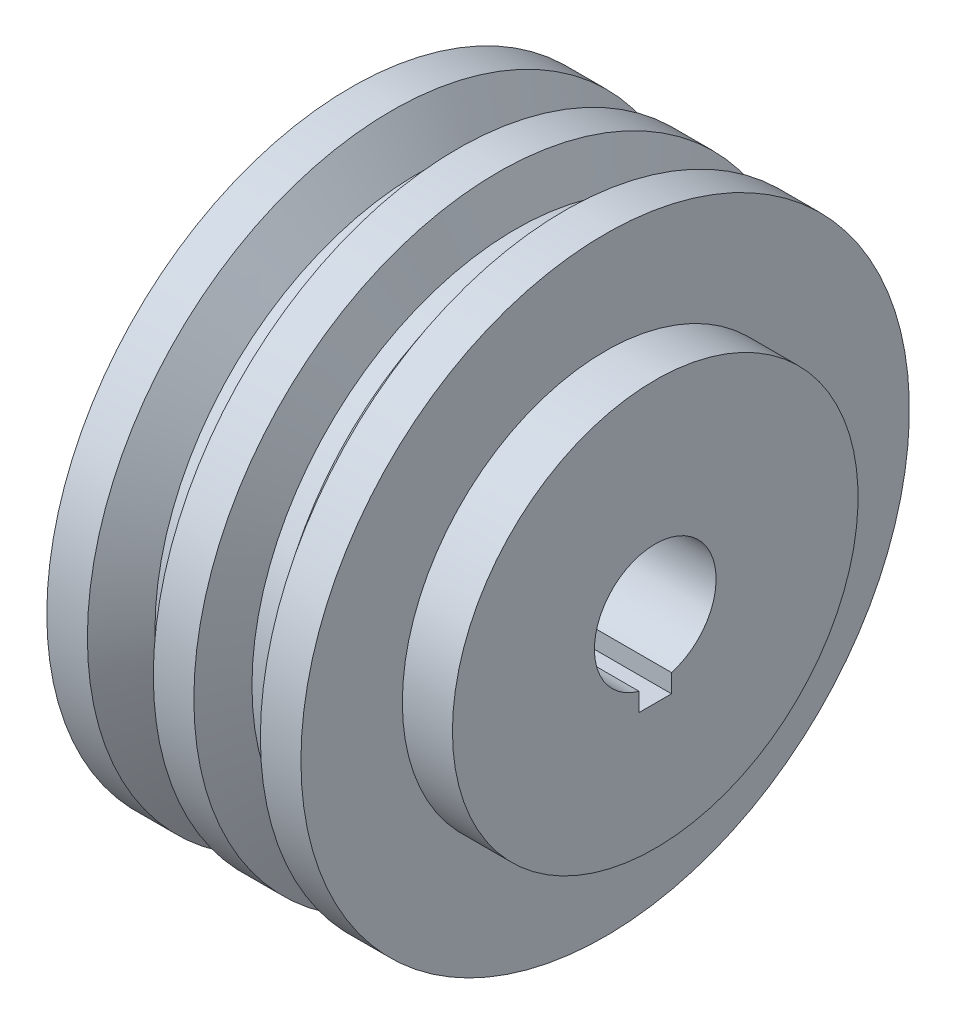
ISO-10303-21;
HEADER;
FILE_DESCRIPTION(('STEP AP214'),'2;1');
FILE_NAME('part.step','',(''),(''),'','','');
FILE_SCHEMA(('AUTOMOTIVE_DESIGN { 1 0 10303 214 1 1 1 1 }'));
ENDSEC;
DATA;
#1=APPLICATION_CONTEXT('core data for automotive mechanical design processes');
#2=APPLICATION_PROTOCOL_DEFINITION('international standard','automotive_design',2000,#1);
#3=PRODUCT_CONTEXT('',#1,'mechanical');
#4=PRODUCT('Part','Part','',(#3));
#5=PRODUCT_RELATED_PRODUCT_CATEGORY('part','',(#4));
#6=PRODUCT_DEFINITION_FORMATION('','',#4);
#7=PRODUCT_DEFINITION_CONTEXT('part definition',#1,'design');
#8=PRODUCT_DEFINITION('design','',#6,#7);
#9=PRODUCT_DEFINITION_SHAPE('','',#8);
#10=(LENGTH_UNIT() NAMED_UNIT(*) SI_UNIT(.MILLI.,.METRE.));
#11=(NAMED_UNIT(*) PLANE_ANGLE_UNIT() SI_UNIT($,.RADIAN.));
#12=(NAMED_UNIT(*) SI_UNIT($,.STERADIAN.) SOLID_ANGLE_UNIT());
#13=UNCERTAINTY_MEASURE_WITH_UNIT(LENGTH_MEASURE(1.E-05),#10,'distance_accuracy_value','');
#14=(GEOMETRIC_REPRESENTATION_CONTEXT(3) GLOBAL_UNCERTAINTY_ASSIGNED_CONTEXT((#13)) GLOBAL_UNIT_ASSIGNED_CONTEXT((#10,
#11,#12)) REPRESENTATION_CONTEXT('',''));
#15=CARTESIAN_POINT('',(0.,0.,0.));
#16=DIRECTION('',(0.,0.,1.));
#17=DIRECTION('',(1.,0.,0.));
#18=AXIS2_PLACEMENT_3D('',#15,#16,#17);
#19=CARTESIAN_POINT('',(75.,-15.,0.));
#20=DIRECTION('',(1.,0.,0.));
#21=DIRECTION('',(0.,0.,-1.));
#22=AXIS2_PLACEMENT_3D('',#19,#20,#21);
#23=PLANE('',#22);
#24=DIRECTION('',(0.,-1.,0.));
#25=VECTOR('',#24,1.);
#26=CARTESIAN_POINT('',(75.,-19.,4.));
#27=LINE('',#26,#25);
#28=CARTESIAN_POINT('',(75.,-14.456832294801,4.));
#29=VERTEX_POINT('',#28);
#30=CARTESIAN_POINT('',(75.,-19.,4.));
#31=VERTEX_POINT('',#30);
#32=EDGE_CURVE('E75',#29,#31,#27,.T.);
#33=ORIENTED_EDGE('',*,*,#32,.F.);
#34=CARTESIAN_POINT('',(75.,0.,0.));
#35=DIRECTION('',(-1.,0.,0.));
#36=DIRECTION('',(0.,0.,1.));
#37=AXIS2_PLACEMENT_3D('',#34,#35,#36);
#38=CIRCLE('',#37,15.);
#39=CARTESIAN_POINT('',(75.,-14.456832294801,-4.));
#40=VERTEX_POINT('',#39);
#41=EDGE_CURVE('E142',#29,#40,#38,.T.);
#42=ORIENTED_EDGE('',*,*,#41,.T.);
#43=DIRECTION('',(0.,1.,0.));
#44=VECTOR('',#43,1.);
#45=CARTESIAN_POINT('',(75.,-19.,-4.));
#46=LINE('',#45,#44);
#47=CARTESIAN_POINT('',(75.,-19.,-4.));
#48=VERTEX_POINT('',#47);
#49=EDGE_CURVE('E90',#48,#40,#46,.T.);
#50=ORIENTED_EDGE('',*,*,#49,.F.);
#51=DIRECTION('',(0.,0.,-1.));
#52=VECTOR('',#51,1.);
#53=CARTESIAN_POINT('',(75.,-19.,-4.));
#54=LINE('',#53,#52);
#55=EDGE_CURVE('E84',#31,#48,#54,.T.);
#56=ORIENTED_EDGE('',*,*,#55,.F.);
#57=EDGE_LOOP('',(#33,#42,#50,#56));
#58=FACE_BOUND('',#57,.T.);
#59=CARTESIAN_POINT('',(75.,0.,0.));
#60=DIRECTION('',(-1.,0.,0.));
#61=DIRECTION('',(0.,0.,1.));
#62=AXIS2_PLACEMENT_3D('',#59,#60,#61);
#63=CIRCLE('',#62,50.);
#64=CARTESIAN_POINT('',(75.,0.,50.));
#65=VERTEX_POINT('',#64);
#66=EDGE_CURVE('E100',#65,#65,#63,.T.);
#67=ORIENTED_EDGE('',*,*,#66,.F.);
#68=EDGE_LOOP('',(#67));
#69=FACE_BOUND('',#68,.T.);
#70=ADVANCED_FACE('F33',(#58,#69),#23,.T.);
#71=CARTESIAN_POINT('',(0.,0.,0.));
#72=DIRECTION('',(-1.,0.,0.));
#73=DIRECTION('',(0.,0.,1.));
#74=AXIS2_PLACEMENT_3D('',#71,#72,#73);
#75=CYLINDRICAL_SURFACE('',#74,15.);
#76=DIRECTION('',(-1.,0.,0.));
#77=VECTOR('',#76,1.);
#78=CARTESIAN_POINT('',(0.,-14.456832294801,4.));
#79=LINE('',#78,#77);
#80=CARTESIAN_POINT('',(10.,-14.456832294801,4.));
#81=VERTEX_POINT('',#80);
#82=EDGE_CURVE('E79',#81,#29,#79,.F.);
#83=ORIENTED_EDGE('',*,*,#82,.F.);
#84=CARTESIAN_POINT('',(10.,0.,0.));
#85=DIRECTION('',(-1.,0.,0.));
#86=DIRECTION('',(0.,0.,1.));
#87=AXIS2_PLACEMENT_3D('',#84,#85,#86);
#88=CIRCLE('',#87,15.);
#89=CARTESIAN_POINT('',(10.,-14.456832294801,-4.));
#90=VERTEX_POINT('',#89);
#91=EDGE_CURVE('E139',#81,#90,#88,.T.);
#92=ORIENTED_EDGE('',*,*,#91,.T.);
#93=DIRECTION('',(-1.,0.,0.));
#94=VECTOR('',#93,1.);
#95=CARTESIAN_POINT('',(0.,-14.456832294801,-4.));
#96=LINE('',#95,#94);
#97=EDGE_CURVE('E96',#40,#90,#96,.T.);
#98=ORIENTED_EDGE('',*,*,#97,.F.);
#99=ORIENTED_EDGE('',*,*,#41,.F.);
#100=EDGE_LOOP('',(#83,#92,#98,#99));
#101=FACE_BOUND('',#100,.T.);
#102=ADVANCED_FACE('F211',(#101),#75,.F.);
#103=CARTESIAN_POINT('',(10.,0.,0.));
#104=DIRECTION('',(-1.,0.,0.));
#105=DIRECTION('',(0.,0.,1.));
#106=AXIS2_PLACEMENT_3D('',#103,#104,#105);
#107=CONICAL_SURFACE('',#106,15.,1.39094282700242);
#108=CARTESIAN_POINT('',(6.39443841975416,-34.6001431873648,4.));
#109=CARTESIAN_POINT('',(6.65724573665439,-33.14490925138,4.));
#110=CARTESIAN_POINT('',(6.91989497160682,-31.689646588921,4.));
#111=CARTESIAN_POINT('',(7.44451726248369,-28.7791834678463,4.));
#112=CARTESIAN_POINT('',(7.70649039729603,-27.3239830234475,4.));
#113=CARTESIAN_POINT('',(8.09868011663034,-25.1412809404281,4.));
#114=CARTESIAN_POINT('',(8.22926114577589,-24.4138448019778,4.));
#115=CARTESIAN_POINT('',(8.49010116807986,-22.9589173210629,4.));
#116=CARTESIAN_POINT('',(8.62036016232725,-22.2314259787938,4.));
#117=CARTESIAN_POINT('',(8.88046981475311,-20.7762837310661,4.));
#118=CARTESIAN_POINT('',(9.01032042412981,-20.048632816881,4.));
#119=CARTESIAN_POINT('',(9.26944658544549,-18.5932192798698,4.));
#120=CARTESIAN_POINT('',(9.39872213025516,-17.8654566557738,4.));
#121=CARTESIAN_POINT('',(9.65430689130182,-16.4219643101513,4.));
#122=CARTESIAN_POINT('',(9.78062955118175,-15.7062369712816,4.));
#123=CARTESIAN_POINT('',(10.0321256096589,-14.2746132663618,4.));
#124=CARTESIAN_POINT('',(10.157299059378,-13.5587169092978,4.));
#125=CARTESIAN_POINT('',(10.4058634416107,-12.1268864958551,4.));
#126=CARTESIAN_POINT('',(10.5292550163011,-11.410952551358,4.));
#127=CARTESIAN_POINT('',(10.7122023396851,-10.3366264010246,4.));
#128=CARTESIAN_POINT('',(10.7728329961803,-9.97841739412837,4.));
#129=CARTESIAN_POINT('',(10.8931369443984,-9.26183881146511,4.));
#130=CARTESIAN_POINT('',(10.9528102371887,-8.90346923587753,4.));
#131=CARTESIAN_POINT('',(11.0709487652725,-8.18604346700138,4.));
#132=CARTESIAN_POINT('',(11.1294122976824,-7.82698699261588,4.));
#133=CARTESIAN_POINT('',(11.2445535787055,-7.10859497637306,4.));
#134=CARTESIAN_POINT('',(11.3012313662188,-6.74925944076965,4.));
#135=CARTESIAN_POINT('',(11.4120224327451,-6.03037545693457,4.));
#136=CARTESIAN_POINT('',(11.4661369864016,-5.6708272064922,4.));
#137=CARTESIAN_POINT('',(11.5706606837461,-4.95115502722994,4.));
#138=CARTESIAN_POINT('',(11.6210694812827,-4.59103104783378,4.));
#139=CARTESIAN_POINT('',(11.7164166351216,-3.8693881735717,4.));
#140=CARTESIAN_POINT('',(11.7613450813547,-3.50786793651586,4.));
#141=CARTESIAN_POINT('',(11.8223607490261,-2.96491409854611,4.));
#142=CARTESIAN_POINT('',(11.8416344661936,-2.78383985044046,4.));
#143=CARTESIAN_POINT('',(11.877572694754,-2.42142859084247,4.));
#144=CARTESIAN_POINT('',(11.8942371871716,-2.24009157744888,4.));
#145=CARTESIAN_POINT('',(11.9244591212835,-1.87683365944807,4.));
#146=CARTESIAN_POINT('',(11.9380110301653,-1.69491228912454,4.));
#147=CARTESIAN_POINT('',(11.9614292267963,-1.33083609914876,4.));
#148=CARTESIAN_POINT('',(11.9712956580584,-1.14868128886391,4.));
#149=CARTESIAN_POINT('',(11.9868592480669,-0.784020468197573,4.));
#150=CARTESIAN_POINT('',(11.9925525240417,-0.601514288755223,4.));
#151=CARTESIAN_POINT('',(11.9994910069143,-0.236390491266642,4.));
#152=CARTESIAN_POINT('',(12.0007355322295,-0.0537728604314214,4.));
#153=CARTESIAN_POINT('',(11.9996228476055,0.128837138415995,4.));
#154=B_SPLINE_CURVE_WITH_KNOTS('',3,(#108,#109,#110,#111,#112,#113,#114,#115,#116,#117,#118,
#119,#120,#121,#122,#123,#124,#125,#126,#127,#128,#129,#130,#131,#132,#133,#134,#135,#136,#137,
#138,#139,#140,#141,#142,#143,#144,#145,#146,#147,#148,#149,#150,#151,#152,#153),.UNSPECIFIED.,
.F.,.F.,(4,2,2,2,2,2,2,2,2,2,2,2,2,2,2,2,2,2,2,2,2,2,4),(0.,4.43632324181381,8.87210305318458,
11.0892932611385,13.3064759612918,15.5239142467702,17.7413799465459,19.9217478906655,
22.1020183677764,24.2814824264146,25.3713933816991,26.4613031218255,27.5526549526626,
28.6439829934457,29.7347625159651,30.8256437981284,31.9184693528809,32.4647459679502,
33.011026555589,33.5582708029265,34.1054937383066,34.653225174754,35.2010405242384),.UNSPECIFIED.);
#155=CARTESIAN_POINT('',(9.19700221110044,-19.,4.));
#156=VERTEX_POINT('',#155);
#157=EDGE_CURVE('E11',#156,#81,#154,.T.);
#158=ORIENTED_EDGE('',*,*,#157,.F.);
#159=CARTESIAN_POINT('',(7.54557386228406,-19.,-21.241765336351));
#160=CARTESIAN_POINT('',(7.65386469469078,-19.,-20.4423439312438));
#161=CARTESIAN_POINT('',(7.75957175496758,-19.,-19.6425633058687));
#162=CARTESIAN_POINT('',(7.96449660302058,-19.,-18.0421296385324));
#163=CARTESIAN_POINT('',(8.06371404483216,-19.,-17.2414765523694));
#164=CARTESIAN_POINT('',(8.25442855819279,-19.,-15.6383679551754));
#165=CARTESIAN_POINT('',(8.34591721602016,-19.,-14.8359114317958));
#166=CARTESIAN_POINT('',(8.51938849970379,-19.,-13.229992055274));
#167=CARTESIAN_POINT('',(8.60137124117887,-19.,-12.4265292144917));
#168=CARTESIAN_POINT('',(8.82932016987789,-19.,-10.0238824669169));
#169=CARTESIAN_POINT('',(8.95845402472932,-19.,-8.42299138295178));
#170=CARTESIAN_POINT('',(9.10610891502273,-19.,-6.01923790791078));
#171=CARTESIAN_POINT('',(9.14764857874721,-19.,-5.21777089185556));
#172=CARTESIAN_POINT('',(9.21365172001666,-19.,-3.61412227534424));
#173=CARTESIAN_POINT('',(9.23811531408736,-19.,-2.81194067980177));
#174=CARTESIAN_POINT('',(9.26882068132095,-19.,-1.2062225394813));
#175=CARTESIAN_POINT('',(9.27503965987076,-19.,-0.402685553683389));
#176=CARTESIAN_POINT('',(9.26887770061269,-19.,1.20431813597053));
#177=CARTESIAN_POINT('',(9.25649672103876,-19.,2.00778483966467));
#178=CARTESIAN_POINT('',(9.21374209016293,-19.,3.61460913089635));
#179=CARTESIAN_POINT('',(9.1833599911523,-19.,4.41796648995722));
#180=CARTESIAN_POINT('',(9.10599882753106,-19.,6.02387054594547));
#181=CARTESIAN_POINT('',(9.0590197525294,-19.,6.82641724236499));
#182=CARTESIAN_POINT('',(8.95004711197291,-19.,8.4350818249938));
#183=CARTESIAN_POINT('',(8.88796934619802,-19.,9.24119393669721));
#184=CARTESIAN_POINT('',(8.75103711112847,-19.,10.8523412666602));
#185=CARTESIAN_POINT('',(8.67618233391624,-19.,11.6573764584955));
#186=CARTESIAN_POINT('',(8.51581820553747,-19.,13.2656423187013));
#187=CARTESIAN_POINT('',(8.4303185014602,-19.,14.0688739589768));
#188=CARTESIAN_POINT('',(8.25038470118699,-19.,15.6742649709507));
#189=CARTESIAN_POINT('',(8.1559514211362,-19.,16.4764244338231));
#190=CARTESIAN_POINT('',(8.05792984012609,-19.,17.2781243392286));
#191=B_SPLINE_CURVE_WITH_KNOTS('',3,(#159,#160,#161,#162,#163,#164,#165,#166,#167,#168,#169,
#170,#171,#172,#173,#174,#175,#176,#177,#178,#179,#180,#181,#182,#183,#184,#185,#186,#187,#188,
#189,#190),.UNSPECIFIED.,.F.,.F.,(4,2,2,2,2,2,2,2,2,2,2,2,2,2,2,4),(0.,2.42017644355844,
4.84048180288176,7.26338888841947,9.68626650146734,14.5034665996628,16.9109454602554,
19.3184078922426,21.7288769018551,24.1393513241638,26.5509578500941,28.9625658858876,
31.3879440685522,33.8133807094908,36.2366350553444,38.6596682332275),.UNSPECIFIED.);
#192=CARTESIAN_POINT('',(9.19700221110044,-19.,-4.));
#193=VERTEX_POINT('',#192);
#194=EDGE_CURVE('E89',#193,#156,#191,.T.);
#195=ORIENTED_EDGE('',*,*,#194,.F.);
#196=CARTESIAN_POINT('',(11.9996228476055,0.128837138415995,-4.));
#197=CARTESIAN_POINT('',(12.000644607484,-0.0401455272244546,-4.));
#198=CARTESIAN_POINT('',(11.9996576686728,-0.209135817737427,-4.));
#199=CARTESIAN_POINT('',(11.9938591797292,-0.547031410195951,-4.));
#200=CARTESIAN_POINT('',(11.9890480839297,-0.715936719852585,-4.));
#201=CARTESIAN_POINT('',(11.9758005124165,-1.05344194372298,-4.));
#202=CARTESIAN_POINT('',(11.9673674843335,-1.22204199562888,-4.));
#203=CARTESIAN_POINT('',(11.9472469386636,-1.55905029924299,-4.));
#204=CARTESIAN_POINT('',(11.9355593239443,-1.72745854507616,-4.));
#205=CARTESIAN_POINT('',(11.9093687026144,-2.06381630442373,-4.));
#206=CARTESIAN_POINT('',(11.8948696610325,-2.23176613008065,-4.));
#207=CARTESIAN_POINT('',(11.863473268363,-2.56743858959125,-4.));
#208=CARTESIAN_POINT('',(11.8465759297875,-2.7351612246256,-4.));
#209=CARTESIAN_POINT('',(11.8107724553548,-3.07043939266686,-4.));
#210=CARTESIAN_POINT('',(11.7918657419625,-3.23799486358363,-4.));
#211=CARTESIAN_POINT('',(11.7523908863715,-3.57290836847775,-4.));
#212=CARTESIAN_POINT('',(11.7318227484055,-3.74026640295699,-4.));
#213=CARTESIAN_POINT('',(11.6754056703762,-4.18433619634086,-4.));
#214=CARTESIAN_POINT('',(11.6383696080368,-4.46089687481311,-4.));
#215=CARTESIAN_POINT('',(11.5615798695978,-5.01364223400766,-4.));
#216=CARTESIAN_POINT('',(11.5218261395194,-5.28982690715048,-4.));
#217=CARTESIAN_POINT('',(11.4403130317911,-5.84191575550074,-4.));
#218=CARTESIAN_POINT('',(11.3985535353366,-6.11781991310198,-4.));
#219=CARTESIAN_POINT('',(11.3135316773804,-6.66939703914008,-4.));
#220=CARTESIAN_POINT('',(11.2702693085659,-6.94507000644532,-4.));
#221=CARTESIAN_POINT('',(11.1387843536908,-7.77185457807673,-4.));
#222=CARTESIAN_POINT('',(11.0488692366661,-8.32269655470177,-4.));
#223=CARTESIAN_POINT('',(10.8663252079551,-9.42390646074715,-4.));
#224=CARTESIAN_POINT('',(10.7736963955441,-9.97427440675262,-4.));
#225=CARTESIAN_POINT('',(10.586449374015,-11.0760056572817,-4.));
#226=CARTESIAN_POINT('',(10.4918269917974,-11.6273682516768,-4.));
#227=CARTESIAN_POINT('',(10.3013739880431,-12.7298894434904,-4.));
#228=CARTESIAN_POINT('',(10.2055433555375,-13.2810480390101,-4.));
#229=CARTESIAN_POINT('',(9.91680990589268,-14.9342114586883,-4.));
#230=CARTESIAN_POINT('',(9.7226496610595,-16.0359964735179,-4.));
#231=CARTESIAN_POINT('',(9.26937985232763,-18.5959316495553,-4.));
#232=CARTESIAN_POINT('',(9.00959545486078,-20.0539619793387,-4.));
#233=CARTESIAN_POINT('',(8.48837028946634,-22.9697711297575,-4.));
#234=CARTESIAN_POINT('',(8.22692947231975,-24.4275499415846,-4.));
#235=CARTESIAN_POINT('',(7.70398723633828,-27.3378826277832,-4.));
#236=CARTESIAN_POINT('',(7.44248916634197,-28.7904371043081,-4.));
#237=CARTESIAN_POINT('',(6.91886026169807,-31.6953851367189,-4.));
#238=CARTESIAN_POINT('',(6.65672944708893,-33.1477786962159,-4.));
#239=CARTESIAN_POINT('',(6.39443841975416,-34.6001431873648,-4.));
#240=B_SPLINE_CURVE_WITH_KNOTS('',3,(#196,#197,#198,#199,#200,#201,#202,#203,#204,#205,#206,
#207,#208,#209,#210,#211,#212,#213,#214,#215,#216,#217,#218,#219,#220,#221,#222,#223,#224,#225,
#226,#227,#228,#229,#230,#231,#232,#233,#234,#235,#236,#237,#238,#239),.UNSPECIFIED.,.F.,.F.,(4,
2,2,2,2,2,2,2,2,2,2,2,2,2,2,2,2,2,2,2,2,4),(0.,0.506938881136907,1.0138175438918,
1.52021478656798,2.02662714416075,2.53233042270092,3.03803106304236,3.54387744710864,
4.04972254250813,4.88679021380747,5.72387451592565,6.56100846108525,7.39814648018299,
9.07252960156823,10.7468515451678,12.4251184489993,14.1034005998222,17.4596831753868,
21.9026607798986,26.3457710284615,30.7734860508262,35.2010626445307),.UNSPECIFIED.);
#241=EDGE_CURVE('E45',#90,#193,#240,.T.);
#242=ORIENTED_EDGE('',*,*,#241,.F.);
#243=ORIENTED_EDGE('',*,*,#91,.F.);
#244=EDGE_LOOP('',(#158,#195,#242,#243));
#245=FACE_BOUND('',#244,.T.);
#246=CARTESIAN_POINT('',(0.,0.,0.));
#247=DIRECTION('',(-1.,0.,0.));
#248=DIRECTION('',(0.,0.,1.));
#249=AXIS2_PLACEMENT_3D('',#246,#247,#248);
#250=CIRCLE('',#249,70.);
#251=CARTESIAN_POINT('',(0.,0.,70.));
#252=VERTEX_POINT('',#251);
#253=EDGE_CURVE('E136',#252,#252,#250,.T.);
#254=ORIENTED_EDGE('',*,*,#253,.T.);
#255=EDGE_LOOP('',(#254));
#256=FACE_BOUND('',#255,.T.);
#257=ADVANCED_FACE('F152',(#245,#256),#107,.F.);
#258=CARTESIAN_POINT('',(0.,-75.,0.));
#259=DIRECTION('',(-1.,0.,0.));
#260=DIRECTION('',(0.,0.,1.));
#261=AXIS2_PLACEMENT_3D('',#258,#259,#260);
#262=PLANE('',#261);
#263=CARTESIAN_POINT('',(0.,0.,0.));
#264=DIRECTION('',(-1.,0.,0.));
#265=DIRECTION('',(0.,0.,1.));
#266=AXIS2_PLACEMENT_3D('',#263,#264,#265);
#267=CIRCLE('',#266,75.);
#268=CARTESIAN_POINT('',(0.,0.,75.));
#269=VERTEX_POINT('',#268);
#270=EDGE_CURVE('E133',#269,#269,#267,.T.);
#271=ORIENTED_EDGE('',*,*,#270,.T.);
#272=EDGE_LOOP('',(#271));
#273=FACE_BOUND('',#272,.T.);
#274=ORIENTED_EDGE('',*,*,#253,.F.);
#275=EDGE_LOOP('',(#274));
#276=FACE_BOUND('',#275,.T.);
#277=ADVANCED_FACE('F204',(#273,#276),#262,.T.);
#278=CARTESIAN_POINT('',(0.,0.,0.));
#279=DIRECTION('',(-1.,0.,0.));
#280=DIRECTION('',(0.,0.,1.));
#281=AXIS2_PLACEMENT_3D('',#278,#279,#280);
#282=CYLINDRICAL_SURFACE('',#281,75.);
#283=CARTESIAN_POINT('',(10.,0.,0.));
#284=DIRECTION('',(-1.,0.,0.));
#285=DIRECTION('',(0.,0.,1.));
#286=AXIS2_PLACEMENT_3D('',#283,#284,#285);
#287=CIRCLE('',#286,75.);
#288=CARTESIAN_POINT('',(10.,0.,75.));
#289=VERTEX_POINT('',#288);
#290=EDGE_CURVE('E130',#289,#289,#287,.T.);
#291=ORIENTED_EDGE('',*,*,#290,.T.);
#292=EDGE_LOOP('',(#291));
#293=FACE_BOUND('',#292,.T.);
#294=ORIENTED_EDGE('',*,*,#270,.F.);
#295=EDGE_LOOP('',(#294));
#296=FACE_BOUND('',#295,.T.);
#297=ADVANCED_FACE('F201',(#293,#296),#282,.T.);
#298=CARTESIAN_POINT('',(10.,0.,0.));
#299=DIRECTION('',(-1.,0.,0.));
#300=DIRECTION('',(0.,0.,1.));
#301=AXIS2_PLACEMENT_3D('',#298,#299,#300);
#302=CONICAL_SURFACE('',#301,75.,0.983258619852714);
#303=CARTESIAN_POINT('',(16.6599535735903,0.,0.));
#304=DIRECTION('',(-1.,0.,0.));
#305=DIRECTION('',(0.,0.,1.));
#306=AXIS2_PLACEMENT_3D('',#303,#304,#305);
#307=CIRCLE('',#306,65.);
#308=CARTESIAN_POINT('',(16.6599535735903,0.,65.));
#309=VERTEX_POINT('',#308);
#310=EDGE_CURVE('E127',#309,#309,#307,.T.);
#311=ORIENTED_EDGE('',*,*,#310,.T.);
#312=EDGE_LOOP('',(#311));
#313=FACE_BOUND('',#312,.T.);
#314=ORIENTED_EDGE('',*,*,#290,.F.);
#315=EDGE_LOOP('',(#314));
#316=FACE_BOUND('',#315,.T.);
#317=ADVANCED_FACE('F197',(#313,#316),#302,.T.);
#318=CARTESIAN_POINT('',(0.,0.,0.));
#319=DIRECTION('',(-1.,0.,0.));
#320=DIRECTION('',(0.,0.,1.));
#321=AXIS2_PLACEMENT_3D('',#318,#319,#320);
#322=CYLINDRICAL_SURFACE('',#321,65.);
#323=CARTESIAN_POINT('',(21.2999535735903,0.,0.));
#324=DIRECTION('',(-1.,0.,0.));
#325=DIRECTION('',(0.,0.,1.));
#326=AXIS2_PLACEMENT_3D('',#323,#324,#325);
#327=CIRCLE('',#326,65.);
#328=CARTESIAN_POINT('',(21.2999535735903,0.,65.));
#329=VERTEX_POINT('',#328);
#330=EDGE_CURVE('E124',#329,#329,#327,.T.);
#331=ORIENTED_EDGE('',*,*,#330,.T.);
#332=EDGE_LOOP('',(#331));
#333=FACE_BOUND('',#332,.T.);
#334=ORIENTED_EDGE('',*,*,#310,.F.);
#335=EDGE_LOOP('',(#334));
#336=FACE_BOUND('',#335,.T.);
#337=ADVANCED_FACE('F193',(#333,#336),#322,.T.);
#338=CARTESIAN_POINT('',(21.2999535735903,0.,0.));
#339=DIRECTION('',(1.,0.,0.));
#340=DIRECTION('',(0.,0.,-1.));
#341=AXIS2_PLACEMENT_3D('',#338,#339,#340);
#342=CONICAL_SURFACE('',#341,65.,1.11113648254049);
#343=CARTESIAN_POINT('',(26.2502054424791,0.,0.));
#344=DIRECTION('',(-1.,0.,0.));
#345=DIRECTION('',(0.,0.,1.));
#346=AXIS2_PLACEMENT_3D('',#343,#344,#345);
#347=CIRCLE('',#346,75.);
#348=CARTESIAN_POINT('',(26.2502054424791,0.,75.));
#349=VERTEX_POINT('',#348);
#350=EDGE_CURVE('E121',#349,#349,#347,.T.);
#351=ORIENTED_EDGE('',*,*,#350,.T.);
#352=EDGE_LOOP('',(#351));
#353=FACE_BOUND('',#352,.T.);
#354=ORIENTED_EDGE('',*,*,#330,.F.);
#355=EDGE_LOOP('',(#354));
#356=FACE_BOUND('',#355,.T.);
#357=ADVANCED_FACE('F189',(#353,#356),#342,.T.);
#358=CARTESIAN_POINT('',(0.,0.,0.));
#359=DIRECTION('',(-1.,0.,0.));
#360=DIRECTION('',(0.,0.,1.));
#361=AXIS2_PLACEMENT_3D('',#358,#359,#360);
#362=CYLINDRICAL_SURFACE('',#361,75.);
#363=CARTESIAN_POINT('',(36.2502054424791,0.,0.));
#364=DIRECTION('',(-1.,0.,0.));
#365=DIRECTION('',(0.,0.,1.));
#366=AXIS2_PLACEMENT_3D('',#363,#364,#365);
#367=CIRCLE('',#366,75.);
#368=CARTESIAN_POINT('',(36.2502054424791,0.,75.));
#369=VERTEX_POINT('',#368);
#370=EDGE_CURVE('E118',#369,#369,#367,.T.);
#371=ORIENTED_EDGE('',*,*,#370,.T.);
#372=EDGE_LOOP('',(#371));
#373=FACE_BOUND('',#372,.T.);
#374=ORIENTED_EDGE('',*,*,#350,.F.);
#375=EDGE_LOOP('',(#374));
#376=FACE_BOUND('',#375,.T.);
#377=ADVANCED_FACE('F185',(#373,#376),#362,.T.);
#378=CARTESIAN_POINT('',(36.2502054424791,0.,0.));
#379=DIRECTION('',(-1.,0.,0.));
#380=DIRECTION('',(0.,0.,1.));
#381=AXIS2_PLACEMENT_3D('',#378,#379,#380);
#382=CONICAL_SURFACE('',#381,75.,1.16292080364232);
#383=CARTESIAN_POINT('',(40.5712827551038,0.,0.));
#384=DIRECTION('',(-1.,0.,0.));
#385=DIRECTION('',(0.,0.,1.));
#386=AXIS2_PLACEMENT_3D('',#383,#384,#385);
#387=CIRCLE('',#386,65.);
#388=CARTESIAN_POINT('',(40.5712827551038,0.,65.));
#389=VERTEX_POINT('',#388);
#390=EDGE_CURVE('E115',#389,#389,#387,.T.);
#391=ORIENTED_EDGE('',*,*,#390,.T.);
#392=EDGE_LOOP('',(#391));
#393=FACE_BOUND('',#392,.T.);
#394=ORIENTED_EDGE('',*,*,#370,.F.);
#395=EDGE_LOOP('',(#394));
#396=FACE_BOUND('',#395,.T.);
#397=ADVANCED_FACE('F181',(#393,#396),#382,.T.);
#398=CARTESIAN_POINT('',(0.,0.,0.));
#399=DIRECTION('',(-1.,0.,0.));
#400=DIRECTION('',(0.,0.,1.));
#401=AXIS2_PLACEMENT_3D('',#398,#399,#400);
#402=CYLINDRICAL_SURFACE('',#401,65.);
#403=CARTESIAN_POINT('',(45.2112827551038,0.,0.));
#404=DIRECTION('',(-1.,0.,0.));
#405=DIRECTION('',(0.,0.,1.));
#406=AXIS2_PLACEMENT_3D('',#403,#404,#405);
#407=CIRCLE('',#406,65.);
#408=CARTESIAN_POINT('',(45.2112827551038,0.,65.));
#409=VERTEX_POINT('',#408);
#410=EDGE_CURVE('E112',#409,#409,#407,.T.);
#411=ORIENTED_EDGE('',*,*,#410,.T.);
#412=EDGE_LOOP('',(#411));
#413=FACE_BOUND('',#412,.T.);
#414=ORIENTED_EDGE('',*,*,#390,.F.);
#415=EDGE_LOOP('',(#414));
#416=FACE_BOUND('',#415,.T.);
#417=ADVANCED_FACE('F177',(#413,#416),#402,.T.);
#418=CARTESIAN_POINT('',(45.2112827551038,0.,0.));
#419=DIRECTION('',(1.,0.,0.));
#420=DIRECTION('',(0.,0.,-1.));
#421=AXIS2_PLACEMENT_3D('',#418,#419,#420);
#422=CONICAL_SURFACE('',#421,65.,0.931474298750879);
#423=CARTESIAN_POINT('',(52.6461882657892,0.,0.));
#424=DIRECTION('',(-1.,0.,0.));
#425=DIRECTION('',(0.,0.,1.));
#426=AXIS2_PLACEMENT_3D('',#423,#424,#425);
#427=CIRCLE('',#426,75.);
#428=CARTESIAN_POINT('',(52.6461882657892,0.,75.));
#429=VERTEX_POINT('',#428);
#430=EDGE_CURVE('E109',#429,#429,#427,.T.);
#431=ORIENTED_EDGE('',*,*,#430,.T.);
#432=EDGE_LOOP('',(#431));
#433=FACE_BOUND('',#432,.T.);
#434=ORIENTED_EDGE('',*,*,#410,.F.);
#435=EDGE_LOOP('',(#434));
#436=FACE_BOUND('',#435,.T.);
#437=ADVANCED_FACE('F173',(#433,#436),#422,.T.);
#438=CARTESIAN_POINT('',(0.,0.,0.));
#439=DIRECTION('',(-1.,0.,0.));
#440=DIRECTION('',(0.,0.,1.));
#441=AXIS2_PLACEMENT_3D('',#438,#439,#440);
#442=CYLINDRICAL_SURFACE('',#441,75.);
#443=CARTESIAN_POINT('',(62.6461882657892,0.,0.));
#444=DIRECTION('',(-1.,0.,0.));
#445=DIRECTION('',(0.,0.,1.));
#446=AXIS2_PLACEMENT_3D('',#443,#444,#445);
#447=CIRCLE('',#446,75.);
#448=CARTESIAN_POINT('',(62.6461882657892,0.,75.));
#449=VERTEX_POINT('',#448);
#450=EDGE_CURVE('E106',#449,#449,#447,.T.);
#451=ORIENTED_EDGE('',*,*,#450,.T.);
#452=EDGE_LOOP('',(#451));
#453=FACE_BOUND('',#452,.T.);
#454=ORIENTED_EDGE('',*,*,#430,.F.);
#455=EDGE_LOOP('',(#454));
#456=FACE_BOUND('',#455,.T.);
#457=ADVANCED_FACE('F169',(#453,#456),#442,.T.);
#458=CARTESIAN_POINT('',(62.6461882657892,-75.,0.));
#459=DIRECTION('',(1.,0.,0.));
#460=DIRECTION('',(0.,0.,-1.));
#461=AXIS2_PLACEMENT_3D('',#458,#459,#460);
#462=PLANE('',#461);
#463=CARTESIAN_POINT('',(62.6461882657892,0.,0.));
#464=DIRECTION('',(-1.,0.,0.));
#465=DIRECTION('',(0.,0.,1.));
#466=AXIS2_PLACEMENT_3D('',#463,#464,#465);
#467=CIRCLE('',#466,50.);
#468=CARTESIAN_POINT('',(62.6461882657892,0.,50.));
#469=VERTEX_POINT('',#468);
#470=EDGE_CURVE('E103',#469,#469,#467,.T.);
#471=ORIENTED_EDGE('',*,*,#470,.T.);
#472=EDGE_LOOP('',(#471));
#473=FACE_BOUND('',#472,.T.);
#474=ORIENTED_EDGE('',*,*,#450,.F.);
#475=EDGE_LOOP('',(#474));
#476=FACE_BOUND('',#475,.T.);
#477=ADVANCED_FACE('F165',(#473,#476),#462,.T.);
#478=CARTESIAN_POINT('',(0.,0.,0.));
#479=DIRECTION('',(-1.,0.,0.));
#480=DIRECTION('',(0.,0.,1.));
#481=AXIS2_PLACEMENT_3D('',#478,#479,#480);
#482=CYLINDRICAL_SURFACE('',#481,50.);
#483=ORIENTED_EDGE('',*,*,#66,.T.);
#484=EDGE_LOOP('',(#483));
#485=FACE_BOUND('',#484,.T.);
#486=ORIENTED_EDGE('',*,*,#470,.F.);
#487=EDGE_LOOP('',(#486));
#488=FACE_BOUND('',#487,.T.);
#489=ADVANCED_FACE('F162',(#485,#488),#482,.T.);
#490=CARTESIAN_POINT('',(0.,-19.,4.));
#491=DIRECTION('',(0.,0.,1.));
#492=DIRECTION('',(1.,0.,0.));
#493=AXIS2_PLACEMENT_3D('',#490,#491,#492);
#494=PLANE('',#493);
#495=ORIENTED_EDGE('',*,*,#82,.T.);
#496=ORIENTED_EDGE('',*,*,#32,.T.);
#497=DIRECTION('',(1.,0.,0.));
#498=VECTOR('',#497,1.);
#499=CARTESIAN_POINT('',(0.,-19.,4.));
#500=LINE('',#499,#498);
#501=EDGE_CURVE('E78',#156,#31,#500,.T.);
#502=ORIENTED_EDGE('',*,*,#501,.F.);
#503=ORIENTED_EDGE('',*,*,#157,.T.);
#504=EDGE_LOOP('',(#495,#496,#502,#503));
#505=FACE_BOUND('',#504,.T.);
#506=ADVANCED_FACE('F77',(#505),#494,.F.);
#507=CARTESIAN_POINT('',(0.,-19.,-4.));
#508=DIRECTION('',(0.,0.,-1.));
#509=DIRECTION('',(-1.,0.,0.));
#510=AXIS2_PLACEMENT_3D('',#507,#508,#509);
#511=PLANE('',#510);
#512=ORIENTED_EDGE('',*,*,#97,.T.);
#513=ORIENTED_EDGE('',*,*,#241,.T.);
#514=DIRECTION('',(1.,0.,0.));
#515=VECTOR('',#514,1.);
#516=CARTESIAN_POINT('',(0.,-19.,-4.));
#517=LINE('',#516,#515);
#518=EDGE_CURVE('E52',#193,#48,#517,.T.);
#519=ORIENTED_EDGE('',*,*,#518,.T.);
#520=ORIENTED_EDGE('',*,*,#49,.T.);
#521=EDGE_LOOP('',(#512,#513,#519,#520));
#522=FACE_BOUND('',#521,.T.);
#523=ADVANCED_FACE('F157',(#522),#511,.F.);
#524=CARTESIAN_POINT('',(0.,-19.,-4.));
#525=DIRECTION('',(0.,-1.,0.));
#526=DIRECTION('',(0.,0.,-1.));
#527=AXIS2_PLACEMENT_3D('',#524,#525,#526);
#528=PLANE('',#527);
#529=ORIENTED_EDGE('',*,*,#194,.T.);
#530=ORIENTED_EDGE('',*,*,#501,.T.);
#531=ORIENTED_EDGE('',*,*,#55,.T.);
#532=ORIENTED_EDGE('',*,*,#518,.F.);
#533=EDGE_LOOP('',(#529,#530,#531,#532));
#534=FACE_BOUND('',#533,.T.);
#535=ADVANCED_FACE('F86',(#534),#528,.F.);
#536=CLOSED_SHELL('',(#70,#102,#257,#277,#297,#317,#337,#357,#377,#397,#417,#437,#457,#477,#489,
#506,#523,#535));
#537=MANIFOLD_SOLID_BREP('B2',#536);
#538=ADVANCED_BREP_SHAPE_REPRESENTATION('',(#18,#537),#14);
#539=SHAPE_DEFINITION_REPRESENTATION(#9,#538);
ENDSEC;
END-ISO-10303-21;
